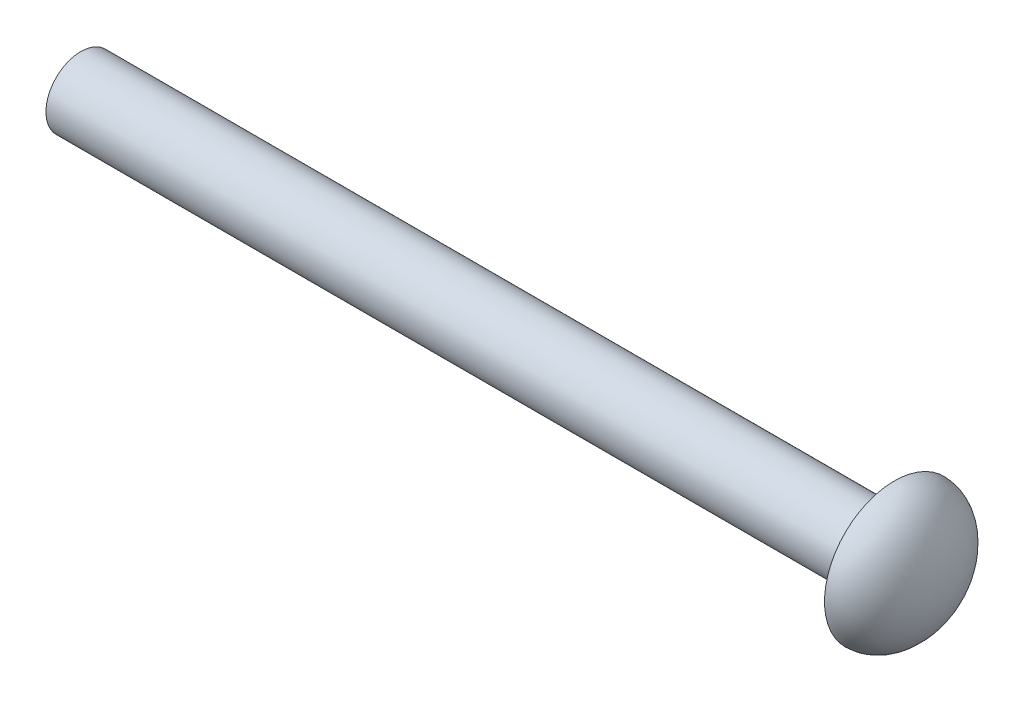
ISO-10303-21;
HEADER;
FILE_DESCRIPTION(('STEP AP214'),'2;1');
FILE_NAME('part.step','',(''),(''),'','','');
FILE_SCHEMA(('AUTOMOTIVE_DESIGN { 1 0 10303 214 1 1 1 1 }'));
ENDSEC;
DATA;
#1=APPLICATION_CONTEXT('core data for automotive mechanical design processes');
#2=APPLICATION_PROTOCOL_DEFINITION('international standard','automotive_design',2000,#1);
#3=PRODUCT_CONTEXT('',#1,'mechanical');
#4=PRODUCT('Part','Part','',(#3));
#5=PRODUCT_RELATED_PRODUCT_CATEGORY('part','',(#4));
#6=PRODUCT_DEFINITION_FORMATION('','',#4);
#7=PRODUCT_DEFINITION_CONTEXT('part definition',#1,'design');
#8=PRODUCT_DEFINITION('design','',#6,#7);
#9=PRODUCT_DEFINITION_SHAPE('','',#8);
#10=(LENGTH_UNIT() NAMED_UNIT(*) SI_UNIT(.MILLI.,.METRE.));
#11=(NAMED_UNIT(*) PLANE_ANGLE_UNIT() SI_UNIT($,.RADIAN.));
#12=(NAMED_UNIT(*) SI_UNIT($,.STERADIAN.) SOLID_ANGLE_UNIT());
#13=UNCERTAINTY_MEASURE_WITH_UNIT(LENGTH_MEASURE(1.E-05),#10,'distance_accuracy_value','');
#14=(GEOMETRIC_REPRESENTATION_CONTEXT(3) GLOBAL_UNCERTAINTY_ASSIGNED_CONTEXT((#13)) GLOBAL_UNIT_ASSIGNED_CONTEXT((#10,
#11,#12)) REPRESENTATION_CONTEXT('',''));
#15=CARTESIAN_POINT('',(0.,0.,0.));
#16=DIRECTION('',(0.,0.,1.));
#17=DIRECTION('',(1.,0.,0.));
#18=AXIS2_PLACEMENT_3D('',#15,#16,#17);
#19=CARTESIAN_POINT('',(35.,0.,0.));
#20=DIRECTION('',(-1.,0.,0.));
#21=DIRECTION('',(0.,0.,1.));
#22=AXIS2_PLACEMENT_3D('',#19,#20,#21);
#23=CYLINDRICAL_SURFACE('',#22,1.5);
#24=CARTESIAN_POINT('',(35.,0.,0.));
#25=DIRECTION('',(1.,0.,0.));
#26=DIRECTION('',(0.,0.,-1.));
#27=AXIS2_PLACEMENT_3D('',#24,#25,#26);
#28=CIRCLE('',#27,1.5);
#29=CARTESIAN_POINT('',(35.,0.,-1.5));
#30=VERTEX_POINT('',#29);
#31=EDGE_CURVE('E11',#30,#30,#28,.T.);
#32=ORIENTED_EDGE('',*,*,#31,.F.);
#33=EDGE_LOOP('',(#32));
#34=FACE_BOUND('',#33,.T.);
#35=CARTESIAN_POINT('',(0.,0.,0.));
#36=DIRECTION('',(1.,0.,0.));
#37=DIRECTION('',(0.,0.,-1.));
#38=AXIS2_PLACEMENT_3D('',#35,#36,#37);
#39=CIRCLE('',#38,1.5);
#40=CARTESIAN_POINT('',(0.,0.,-1.5));
#41=VERTEX_POINT('',#40);
#42=EDGE_CURVE('E36',#41,#41,#39,.T.);
#43=ORIENTED_EDGE('',*,*,#42,.T.);
#44=EDGE_LOOP('',(#43));
#45=FACE_BOUND('',#44,.T.);
#46=ADVANCED_FACE('F33',(#34,#45),#23,.T.);
#47=CARTESIAN_POINT('',(0.,0.,0.));
#48=DIRECTION('',(1.,0.,0.));
#49=DIRECTION('',(0.,0.,-1.));
#50=AXIS2_PLACEMENT_3D('',#47,#48,#49);
#51=PLANE('',#50);
#52=ORIENTED_EDGE('',*,*,#42,.F.);
#53=EDGE_LOOP('',(#52));
#54=FACE_BOUND('',#53,.T.);
#55=ADVANCED_FACE('F45',(#54),#51,.F.);
#56=CARTESIAN_POINT('',(35.,0.,0.));
#57=DIRECTION('',(0.,1.,0.));
#58=DIRECTION('',(0.,0.,-1.));
#59=AXIS2_PLACEMENT_3D('',#56,#57,#58);
#60=ELLIPSE('',#59,3.,2.);
#61=TRIMMED_CURVE('',#60,(PARAMETER_VALUE(4.71238898038469)),
(PARAMETER_VALUE(7.85398163397448)),.T.,.PARAMETER.);
#62=CARTESIAN_POINT('',(37.,0.,0.));
#63=DIRECTION('',(1.,0.,0.));
#64=AXIS1_PLACEMENT('',#62,#63);
#65=SURFACE_OF_REVOLUTION('',#61,#64);
#66=CARTESIAN_POINT('',(35.,0.,0.));
#67=DIRECTION('',(1.,0.,0.));
#68=DIRECTION('',(0.,0.,-1.));
#69=AXIS2_PLACEMENT_3D('',#66,#67,#68);
#70=CIRCLE('',#69,3.);
#71=CARTESIAN_POINT('',(35.,0.,-3.));
#72=VERTEX_POINT('',#71);
#73=EDGE_CURVE('E65',#72,#72,#70,.T.);
#74=ORIENTED_EDGE('',*,*,#73,.T.);
#75=EDGE_LOOP('',(#74));
#76=FACE_BOUND('',#75,.T.);
#77=CARTESIAN_POINT('',(37.,0.,0.));
#78=VERTEX_POINT('',#77);
#79=VERTEX_LOOP('',#78);
#80=FACE_BOUND('',#79,.T.);
#81=ADVANCED_FACE('F42',(#76,#80),#65,.F.);
#82=CARTESIAN_POINT('',(35.,0.,0.));
#83=DIRECTION('',(-1.,0.,0.));
#84=DIRECTION('',(0.,0.,1.));
#85=AXIS2_PLACEMENT_3D('',#82,#83,#84);
#86=PLANE('',#85);
#87=ORIENTED_EDGE('',*,*,#31,.T.);
#88=EDGE_LOOP('',(#87));
#89=FACE_BOUND('',#88,.T.);
#90=ORIENTED_EDGE('',*,*,#73,.F.);
#91=EDGE_LOOP('',(#90));
#92=FACE_BOUND('',#91,.T.);
#93=ADVANCED_FACE('F44',(#89,#92),#86,.T.);
#94=CLOSED_SHELL('',(#46,#55,#81,#93));
#95=MANIFOLD_SOLID_BREP('B2',#94);
#96=ADVANCED_BREP_SHAPE_REPRESENTATION('',(#18,#95),#14);
#97=SHAPE_DEFINITION_REPRESENTATION(#9,#96);
ENDSEC;
END-ISO-10303-21;
